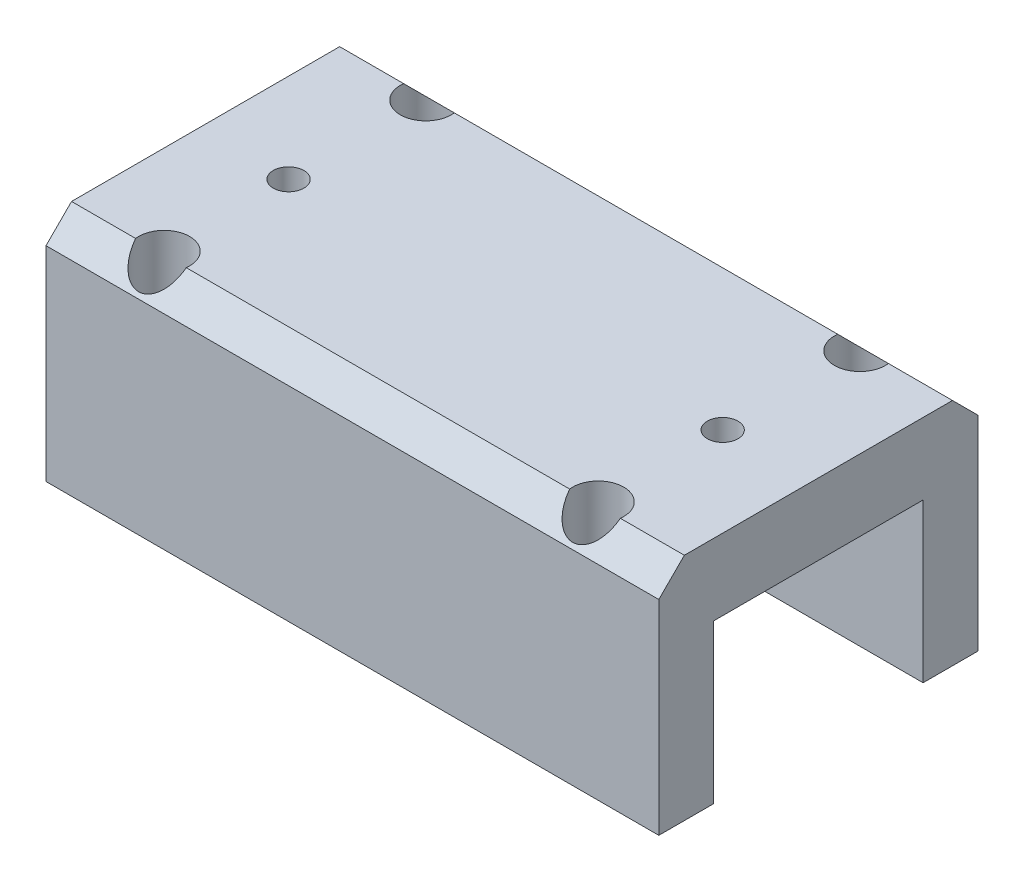
ISO-10303-21;
HEADER;
FILE_DESCRIPTION(('STEP AP214'),'2;1');
FILE_NAME('part.step','',(''),(''),'','','');
FILE_SCHEMA(('AUTOMOTIVE_DESIGN { 1 0 10303 214 1 1 1 1 }'));
ENDSEC;
DATA;
#1=APPLICATION_CONTEXT('core data for automotive mechanical design processes');
#2=APPLICATION_PROTOCOL_DEFINITION('international standard','automotive_design',2000,#1);
#3=PRODUCT_CONTEXT('',#1,'mechanical');
#4=PRODUCT('Part','Part','',(#3));
#5=PRODUCT_RELATED_PRODUCT_CATEGORY('part','',(#4));
#6=PRODUCT_DEFINITION_FORMATION('','',#4);
#7=PRODUCT_DEFINITION_CONTEXT('part definition',#1,'design');
#8=PRODUCT_DEFINITION('design','',#6,#7);
#9=PRODUCT_DEFINITION_SHAPE('','',#8);
#10=(LENGTH_UNIT() NAMED_UNIT(*) SI_UNIT(.MILLI.,.METRE.));
#11=(NAMED_UNIT(*) PLANE_ANGLE_UNIT() SI_UNIT($,.RADIAN.));
#12=(NAMED_UNIT(*) SI_UNIT($,.STERADIAN.) SOLID_ANGLE_UNIT());
#13=UNCERTAINTY_MEASURE_WITH_UNIT(LENGTH_MEASURE(1.E-05),#10,'distance_accuracy_value','');
#14=(GEOMETRIC_REPRESENTATION_CONTEXT(3) GLOBAL_UNCERTAINTY_ASSIGNED_CONTEXT((#13)) GLOBAL_UNIT_ASSIGNED_CONTEXT((#10,
#11,#12)) REPRESENTATION_CONTEXT('',''));
#15=CARTESIAN_POINT('',(0.,0.,0.));
#16=DIRECTION('',(0.,0.,1.));
#17=DIRECTION('',(1.,0.,0.));
#18=AXIS2_PLACEMENT_3D('',#15,#16,#17);
#19=CARTESIAN_POINT('',(-8.5,0.,-5.125));
#20=DIRECTION('',(0.,1.,0.));
#21=DIRECTION('',(0.,0.,1.));
#22=AXIS2_PLACEMENT_3D('',#19,#20,#21);
#23=CYLINDRICAL_SURFACE('',#22,0.500000000000001);
#24=CARTESIAN_POINT('',(-8.5,0.,-5.125));
#25=DIRECTION('',(0.,1.,0.));
#26=DIRECTION('',(0.,0.,1.));
#27=AXIS2_PLACEMENT_3D('',#24,#25,#26);
#28=CIRCLE('',#27,0.500000000000001);
#29=CARTESIAN_POINT('',(-8.5,0.,-4.625));
#30=VERTEX_POINT('',#29);
#31=EDGE_CURVE('E316',#30,#30,#28,.T.);
#32=ORIENTED_EDGE('',*,*,#31,.F.);
#33=EDGE_LOOP('',(#32));
#34=FACE_BOUND('',#33,.T.);
#35=CARTESIAN_POINT('',(-8.5,2.,-5.125));
#36=DIRECTION('',(0.,1.,0.));
#37=DIRECTION('',(0.,0.,1.));
#38=AXIS2_PLACEMENT_3D('',#35,#36,#37);
#39=CIRCLE('',#38,0.500000000000001);
#40=CARTESIAN_POINT('',(-8.5,2.,-4.625));
#41=VERTEX_POINT('',#40);
#42=EDGE_CURVE('E237',#41,#41,#39,.F.);
#43=ORIENTED_EDGE('',*,*,#42,.F.);
#44=EDGE_LOOP('',(#43));
#45=FACE_BOUND('',#44,.T.);
#46=ADVANCED_FACE('F39',(#34,#45),#23,.F.);
#47=CARTESIAN_POINT('',(8.5,0.,-5.125));
#48=DIRECTION('',(0.,1.,0.));
#49=DIRECTION('',(0.,0.,1.));
#50=AXIS2_PLACEMENT_3D('',#47,#48,#49);
#51=CYLINDRICAL_SURFACE('',#50,0.500000000000001);
#52=CARTESIAN_POINT('',(8.5,0.,-5.125));
#53=DIRECTION('',(0.,1.,0.));
#54=DIRECTION('',(0.,0.,-1.));
#55=AXIS2_PLACEMENT_3D('',#52,#53,#54);
#56=CIRCLE('',#55,0.500000000000001);
#57=CARTESIAN_POINT('',(8.5,0.,-5.62500000000001));
#58=VERTEX_POINT('',#57);
#59=EDGE_CURVE('E223',#58,#58,#56,.T.);
#60=ORIENTED_EDGE('',*,*,#59,.F.);
#61=EDGE_LOOP('',(#60));
#62=FACE_BOUND('',#61,.T.);
#63=CARTESIAN_POINT('',(8.5,2.,-5.125));
#64=DIRECTION('',(0.,1.,0.));
#65=DIRECTION('',(0.,0.,1.));
#66=AXIS2_PLACEMENT_3D('',#63,#64,#65);
#67=CIRCLE('',#66,0.500000000000001);
#68=CARTESIAN_POINT('',(8.5,2.,-4.625));
#69=VERTEX_POINT('',#68);
#70=EDGE_CURVE('E233',#69,#69,#67,.F.);
#71=ORIENTED_EDGE('',*,*,#70,.F.);
#72=EDGE_LOOP('',(#71));
#73=FACE_BOUND('',#72,.T.);
#74=ADVANCED_FACE('F389',(#62,#73),#51,.F.);
#75=CARTESIAN_POINT('',(8.5,0.,5.125));
#76=DIRECTION('',(0.,1.,0.));
#77=DIRECTION('',(0.,0.,1.));
#78=AXIS2_PLACEMENT_3D('',#75,#76,#77);
#79=CYLINDRICAL_SURFACE('',#78,0.500000000000001);
#80=CARTESIAN_POINT('',(8.5,0.,5.125));
#81=DIRECTION('',(0.,1.,0.));
#82=DIRECTION('',(0.,0.,1.));
#83=AXIS2_PLACEMENT_3D('',#80,#81,#82);
#84=CIRCLE('',#83,0.500000000000001);
#85=CARTESIAN_POINT('',(8.5,0.,5.62500000000001));
#86=VERTEX_POINT('',#85);
#87=EDGE_CURVE('E322',#86,#86,#84,.T.);
#88=ORIENTED_EDGE('',*,*,#87,.F.);
#89=EDGE_LOOP('',(#88));
#90=FACE_BOUND('',#89,.T.);
#91=CARTESIAN_POINT('',(8.5,2.,5.125));
#92=DIRECTION('',(0.,1.,0.));
#93=DIRECTION('',(0.,0.,1.));
#94=AXIS2_PLACEMENT_3D('',#91,#92,#93);
#95=CIRCLE('',#94,0.500000000000001);
#96=CARTESIAN_POINT('',(8.5,2.,5.62500000000001));
#97=VERTEX_POINT('',#96);
#98=EDGE_CURVE('E228',#97,#97,#95,.F.);
#99=ORIENTED_EDGE('',*,*,#98,.F.);
#100=EDGE_LOOP('',(#99));
#101=FACE_BOUND('',#100,.T.);
#102=ADVANCED_FACE('F392',(#90,#101),#79,.F.);
#103=CARTESIAN_POINT('',(-8.5,0.,5.125));
#104=DIRECTION('',(0.,1.,0.));
#105=DIRECTION('',(0.,0.,1.));
#106=AXIS2_PLACEMENT_3D('',#103,#104,#105);
#107=CYLINDRICAL_SURFACE('',#106,0.500000000000001);
#108=CARTESIAN_POINT('',(-8.5,0.,5.125));
#109=DIRECTION('',(0.,1.,0.));
#110=DIRECTION('',(0.,0.,-1.));
#111=AXIS2_PLACEMENT_3D('',#108,#109,#110);
#112=CIRCLE('',#111,0.500000000000001);
#113=CARTESIAN_POINT('',(-8.5,0.,4.625));
#114=VERTEX_POINT('',#113);
#115=EDGE_CURVE('E378',#114,#114,#112,.T.);
#116=ORIENTED_EDGE('',*,*,#115,.F.);
#117=EDGE_LOOP('',(#116));
#118=FACE_BOUND('',#117,.T.);
#119=CARTESIAN_POINT('',(-8.5,2.,5.125));
#120=DIRECTION('',(0.,1.,0.));
#121=DIRECTION('',(0.,0.,1.));
#122=AXIS2_PLACEMENT_3D('',#119,#120,#121);
#123=CIRCLE('',#122,0.500000000000001);
#124=CARTESIAN_POINT('',(-8.5,2.,5.625));
#125=VERTEX_POINT('',#124);
#126=EDGE_CURVE('E224',#125,#125,#123,.F.);
#127=ORIENTED_EDGE('',*,*,#126,.F.);
#128=EDGE_LOOP('',(#127));
#129=FACE_BOUND('',#128,.T.);
#130=ADVANCED_FACE('F465',(#118,#129),#107,.F.);
#131=CARTESIAN_POINT('',(0.,0.,0.));
#132=DIRECTION('',(0.,1.,0.));
#133=DIRECTION('',(0.,0.,1.));
#134=AXIS2_PLACEMENT_3D('',#131,#132,#133);
#135=PLANE('',#134);
#136=ORIENTED_EDGE('',*,*,#115,.T.);
#137=EDGE_LOOP('',(#136));
#138=FACE_BOUND('',#137,.T.);
#139=ORIENTED_EDGE('',*,*,#87,.T.);
#140=EDGE_LOOP('',(#139));
#141=FACE_BOUND('',#140,.T.);
#142=DIRECTION('',(0.,0.,1.));
#143=VECTOR('',#142,1.);
#144=CARTESIAN_POINT('',(-12.,0.,6.25));
#145=LINE('',#144,#143);
#146=CARTESIAN_POINT('',(-12.,0.,4.1));
#147=VERTEX_POINT('',#146);
#148=CARTESIAN_POINT('',(-12.,0.,6.25));
#149=VERTEX_POINT('',#148);
#150=EDGE_CURVE('E190',#147,#149,#145,.T.);
#151=ORIENTED_EDGE('',*,*,#150,.F.);
#152=DIRECTION('',(-1.,0.,0.));
#153=VECTOR('',#152,1.);
#154=CARTESIAN_POINT('',(12.,0.,4.1));
#155=LINE('',#154,#153);
#156=CARTESIAN_POINT('',(12.,0.,4.1));
#157=VERTEX_POINT('',#156);
#158=EDGE_CURVE('E162',#157,#147,#155,.T.);
#159=ORIENTED_EDGE('',*,*,#158,.F.);
#160=DIRECTION('',(0.,0.,-1.));
#161=VECTOR('',#160,1.);
#162=CARTESIAN_POINT('',(12.,0.,6.25));
#163=LINE('',#162,#161);
#164=CARTESIAN_POINT('',(12.,0.,6.25));
#165=VERTEX_POINT('',#164);
#166=EDGE_CURVE('E195',#165,#157,#163,.T.);
#167=ORIENTED_EDGE('',*,*,#166,.F.);
#168=DIRECTION('',(1.,0.,0.));
#169=VECTOR('',#168,1.);
#170=CARTESIAN_POINT('',(12.,0.,6.25));
#171=LINE('',#170,#169);
#172=EDGE_CURVE('E189',#149,#165,#171,.T.);
#173=ORIENTED_EDGE('',*,*,#172,.F.);
#174=EDGE_LOOP('',(#151,#159,#167,#173));
#175=FACE_BOUND('',#174,.T.);
#176=ADVANCED_FACE('F336',(#138,#141,#175),#135,.F.);
#177=CARTESIAN_POINT('',(-12.,9.,6.25));
#178=DIRECTION('',(1.,0.,0.));
#179=DIRECTION('',(0.,0.,-1.));
#180=AXIS2_PLACEMENT_3D('',#177,#178,#179);
#181=PLANE('',#180);
#182=DIRECTION('',(0.,-1.,0.));
#183=VECTOR('',#182,1.);
#184=CARTESIAN_POINT('',(-12.,9.,6.25));
#185=LINE('',#184,#183);
#186=CARTESIAN_POINT('',(-12.,7.99999999999999,6.25));
#187=VERTEX_POINT('',#186);
#188=EDGE_CURVE('E210',#187,#149,#185,.T.);
#189=ORIENTED_EDGE('',*,*,#188,.F.);
#190=DIRECTION('',(0.,0.707106781186549,-0.707106781186546));
#191=VECTOR('',#190,1.);
#192=CARTESIAN_POINT('',(-12.,9.,5.25));
#193=LINE('',#192,#191);
#194=CARTESIAN_POINT('',(-12.,9.,5.25));
#195=VERTEX_POINT('',#194);
#196=EDGE_CURVE('E277',#187,#195,#193,.T.);
#197=ORIENTED_EDGE('',*,*,#196,.T.);
#198=DIRECTION('',(0.,0.,1.));
#199=VECTOR('',#198,1.);
#200=CARTESIAN_POINT('',(-12.,9.,6.25));
#201=LINE('',#200,#199);
#202=CARTESIAN_POINT('',(-12.,9.,-5.25));
#203=VERTEX_POINT('',#202);
#204=EDGE_CURVE('E177',#203,#195,#201,.T.);
#205=ORIENTED_EDGE('',*,*,#204,.F.);
#206=DIRECTION('',(0.,-0.707106781186549,-0.707106781186546));
#207=VECTOR('',#206,1.);
#208=CARTESIAN_POINT('',(-12.,9.,-5.25));
#209=LINE('',#208,#207);
#210=CARTESIAN_POINT('',(-12.,8.,-6.25));
#211=VERTEX_POINT('',#210);
#212=EDGE_CURVE('E55',#203,#211,#209,.T.);
#213=ORIENTED_EDGE('',*,*,#212,.T.);
#214=DIRECTION('',(0.,-1.,0.));
#215=VECTOR('',#214,1.);
#216=CARTESIAN_POINT('',(-12.,9.,-6.25));
#217=LINE('',#216,#215);
#218=CARTESIAN_POINT('',(-12.,0.,-6.25));
#219=VERTEX_POINT('',#218);
#220=EDGE_CURVE('E186',#211,#219,#217,.T.);
#221=ORIENTED_EDGE('',*,*,#220,.T.);
#222=CARTESIAN_POINT('',(-12.,0.,-4.1));
#223=VERTEX_POINT('',#222);
#224=EDGE_CURVE('E167',#219,#223,#145,.T.);
#225=ORIENTED_EDGE('',*,*,#224,.T.);
#226=DIRECTION('',(0.,-1.,0.));
#227=VECTOR('',#226,1.);
#228=CARTESIAN_POINT('',(-12.,6.2,-4.1));
#229=LINE('',#228,#227);
#230=CARTESIAN_POINT('',(-12.,6.2,-4.1));
#231=VERTEX_POINT('',#230);
#232=EDGE_CURVE('E145',#231,#223,#229,.T.);
#233=ORIENTED_EDGE('',*,*,#232,.F.);
#234=DIRECTION('',(0.,0.,-1.));
#235=VECTOR('',#234,1.);
#236=CARTESIAN_POINT('',(-12.,6.2,-4.1));
#237=LINE('',#236,#235);
#238=CARTESIAN_POINT('',(-12.,6.2,4.1));
#239=VERTEX_POINT('',#238);
#240=EDGE_CURVE('E153',#239,#231,#237,.T.);
#241=ORIENTED_EDGE('',*,*,#240,.F.);
#242=DIRECTION('',(0.,-1.,0.));
#243=VECTOR('',#242,1.);
#244=CARTESIAN_POINT('',(-12.,6.2,4.1));
#245=LINE('',#244,#243);
#246=EDGE_CURVE('E326',#239,#147,#245,.T.);
#247=ORIENTED_EDGE('',*,*,#246,.T.);
#248=ORIENTED_EDGE('',*,*,#150,.T.);
#249=EDGE_LOOP('',(#189,#197,#205,#213,#221,#225,#233,#241,#247,#248));
#250=FACE_BOUND('',#249,.T.);
#251=ADVANCED_FACE('F165',(#250),#181,.F.);
#252=CARTESIAN_POINT('',(12.,9.,6.25));
#253=DIRECTION('',(0.,0.,-1.));
#254=DIRECTION('',(-1.,0.,0.));
#255=AXIS2_PLACEMENT_3D('',#252,#253,#254);
#256=PLANE('',#255);
#257=DIRECTION('',(0.,-1.,0.));
#258=VECTOR('',#257,1.);
#259=CARTESIAN_POINT('',(12.,9.,6.25));
#260=LINE('',#259,#258);
#261=CARTESIAN_POINT('',(12.,7.99999999999999,6.25));
#262=VERTEX_POINT('',#261);
#263=EDGE_CURVE('E207',#262,#165,#260,.T.);
#264=ORIENTED_EDGE('',*,*,#263,.F.);
#265=DIRECTION('',(-1.,0.,0.));
#266=VECTOR('',#265,1.);
#267=CARTESIAN_POINT('',(-12.,7.99999999999999,6.25));
#268=LINE('',#267,#266);
#269=EDGE_CURVE('E63',#262,#187,#268,.T.);
#270=ORIENTED_EDGE('',*,*,#269,.T.);
#271=ORIENTED_EDGE('',*,*,#188,.T.);
#272=ORIENTED_EDGE('',*,*,#172,.T.);
#273=EDGE_LOOP('',(#264,#270,#271,#272));
#274=FACE_BOUND('',#273,.T.);
#275=ADVANCED_FACE('F340',(#274),#256,.F.);
#276=CARTESIAN_POINT('',(12.,9.,6.25));
#277=DIRECTION('',(-1.,0.,0.));
#278=DIRECTION('',(0.,0.,1.));
#279=AXIS2_PLACEMENT_3D('',#276,#277,#278);
#280=PLANE('',#279);
#281=DIRECTION('',(0.,0.,-1.));
#282=VECTOR('',#281,1.);
#283=CARTESIAN_POINT('',(12.,9.,6.25));
#284=LINE('',#283,#282);
#285=CARTESIAN_POINT('',(12.,9.,5.25));
#286=VERTEX_POINT('',#285);
#287=CARTESIAN_POINT('',(12.,9.,-5.25000000000001));
#288=VERTEX_POINT('',#287);
#289=EDGE_CURVE('E181',#286,#288,#284,.T.);
#290=ORIENTED_EDGE('',*,*,#289,.F.);
#291=DIRECTION('',(0.,-0.707106781186549,0.707106781186546));
#292=VECTOR('',#291,1.);
#293=CARTESIAN_POINT('',(12.,9.,5.25));
#294=LINE('',#293,#292);
#295=EDGE_CURVE('E270',#286,#262,#294,.T.);
#296=ORIENTED_EDGE('',*,*,#295,.T.);
#297=ORIENTED_EDGE('',*,*,#263,.T.);
#298=ORIENTED_EDGE('',*,*,#166,.T.);
#299=DIRECTION('',(0.,-1.,0.));
#300=VECTOR('',#299,1.);
#301=CARTESIAN_POINT('',(12.,6.2,4.1));
#302=LINE('',#301,#300);
#303=CARTESIAN_POINT('',(12.,6.2,4.1));
#304=VERTEX_POINT('',#303);
#305=EDGE_CURVE('E172',#304,#157,#302,.T.);
#306=ORIENTED_EDGE('',*,*,#305,.F.);
#307=DIRECTION('',(0.,0.,1.));
#308=VECTOR('',#307,1.);
#309=CARTESIAN_POINT('',(12.,6.2,-4.1));
#310=LINE('',#309,#308);
#311=CARTESIAN_POINT('',(12.,6.2,-4.1));
#312=VERTEX_POINT('',#311);
#313=EDGE_CURVE('E152',#312,#304,#310,.T.);
#314=ORIENTED_EDGE('',*,*,#313,.F.);
#315=DIRECTION('',(0.,-1.,0.));
#316=VECTOR('',#315,1.);
#317=CARTESIAN_POINT('',(12.,6.2,-4.1));
#318=LINE('',#317,#316);
#319=CARTESIAN_POINT('',(12.,0.,-4.1));
#320=VERTEX_POINT('',#319);
#321=EDGE_CURVE('E148',#312,#320,#318,.T.);
#322=ORIENTED_EDGE('',*,*,#321,.T.);
#323=CARTESIAN_POINT('',(12.,0.,-6.25));
#324=VERTEX_POINT('',#323);
#325=EDGE_CURVE('E194',#320,#324,#163,.T.);
#326=ORIENTED_EDGE('',*,*,#325,.T.);
#327=DIRECTION('',(0.,-1.,0.));
#328=VECTOR('',#327,1.);
#329=CARTESIAN_POINT('',(12.,9.,-6.25));
#330=LINE('',#329,#328);
#331=CARTESIAN_POINT('',(12.,8.,-6.25));
#332=VERTEX_POINT('',#331);
#333=EDGE_CURVE('E204',#332,#324,#330,.T.);
#334=ORIENTED_EDGE('',*,*,#333,.F.);
#335=DIRECTION('',(0.,0.707106781186549,0.707106781186546));
#336=VECTOR('',#335,1.);
#337=CARTESIAN_POINT('',(12.,9.,-5.25));
#338=LINE('',#337,#336);
#339=EDGE_CURVE('E267',#332,#288,#338,.T.);
#340=ORIENTED_EDGE('',*,*,#339,.T.);
#341=EDGE_LOOP('',(#290,#296,#297,#298,#306,#314,#322,#326,#334,#340));
#342=FACE_BOUND('',#341,.T.);
#343=ADVANCED_FACE('F308',(#342),#280,.F.);
#344=CARTESIAN_POINT('',(12.,9.,-6.25));
#345=DIRECTION('',(0.,0.,1.));
#346=DIRECTION('',(1.,0.,0.));
#347=AXIS2_PLACEMENT_3D('',#344,#345,#346);
#348=PLANE('',#347);
#349=ORIENTED_EDGE('',*,*,#220,.F.);
#350=DIRECTION('',(1.,0.,0.));
#351=VECTOR('',#350,1.);
#352=CARTESIAN_POINT('',(12.,8.,-6.25));
#353=LINE('',#352,#351);
#354=EDGE_CURVE('E11',#211,#332,#353,.T.);
#355=ORIENTED_EDGE('',*,*,#354,.T.);
#356=ORIENTED_EDGE('',*,*,#333,.T.);
#357=DIRECTION('',(-1.,0.,0.));
#358=VECTOR('',#357,1.);
#359=CARTESIAN_POINT('',(12.,0.,-6.25));
#360=LINE('',#359,#358);
#361=EDGE_CURVE('E182',#324,#219,#360,.T.);
#362=ORIENTED_EDGE('',*,*,#361,.T.);
#363=EDGE_LOOP('',(#349,#355,#356,#362));
#364=FACE_BOUND('',#363,.T.);
#365=ADVANCED_FACE('F304',(#364),#348,.F.);
#366=CARTESIAN_POINT('',(0.,9.,0.));
#367=DIRECTION('',(0.,1.,0.));
#368=DIRECTION('',(0.,0.,1.));
#369=AXIS2_PLACEMENT_3D('',#366,#367,#368);
#370=PLANE('',#369);
#371=ORIENTED_EDGE('',*,*,#204,.T.);
#372=DIRECTION('',(1.,0.,0.));
#373=VECTOR('',#372,1.);
#374=CARTESIAN_POINT('',(12.,9.,5.25));
#375=LINE('',#374,#373);
#376=CARTESIAN_POINT('',(-9.49215674164922,9.,5.25));
#377=VERTEX_POINT('',#376);
#378=EDGE_CURVE('E257',#195,#377,#375,.T.);
#379=ORIENTED_EDGE('',*,*,#378,.T.);
#380=CARTESIAN_POINT('',(-8.5,9.,5.125));
#381=DIRECTION('',(0.,1.,0.));
#382=DIRECTION('',(0.,0.,1.));
#383=AXIS2_PLACEMENT_3D('',#380,#381,#382);
#384=CIRCLE('',#383,1.);
#385=CARTESIAN_POINT('',(-7.50784325835078,9.,5.25));
#386=VERTEX_POINT('',#385);
#387=EDGE_CURVE('E349',#386,#377,#384,.T.);
#388=ORIENTED_EDGE('',*,*,#387,.F.);
#389=DIRECTION('',(1.,0.,0.));
#390=VECTOR('',#389,1.);
#391=CARTESIAN_POINT('',(12.,9.,5.25));
#392=LINE('',#391,#390);
#393=CARTESIAN_POINT('',(7.50784325835078,9.,5.25));
#394=VERTEX_POINT('',#393);
#395=EDGE_CURVE('E254',#386,#394,#392,.T.);
#396=ORIENTED_EDGE('',*,*,#395,.T.);
#397=CARTESIAN_POINT('',(8.5,9.,5.125));
#398=DIRECTION('',(0.,1.,0.));
#399=DIRECTION('',(0.,0.,1.));
#400=AXIS2_PLACEMENT_3D('',#397,#398,#399);
#401=CIRCLE('',#400,1.);
#402=CARTESIAN_POINT('',(9.49215674164922,9.,5.25));
#403=VERTEX_POINT('',#402);
#404=EDGE_CURVE('E362',#403,#394,#401,.T.);
#405=ORIENTED_EDGE('',*,*,#404,.F.);
#406=DIRECTION('',(1.,0.,0.));
#407=VECTOR('',#406,1.);
#408=CARTESIAN_POINT('',(12.,9.,5.25));
#409=LINE('',#408,#407);
#410=EDGE_CURVE('E251',#403,#286,#409,.T.);
#411=ORIENTED_EDGE('',*,*,#410,.T.);
#412=ORIENTED_EDGE('',*,*,#289,.T.);
#413=DIRECTION('',(-1.,0.,0.));
#414=VECTOR('',#413,1.);
#415=CARTESIAN_POINT('',(-12.,9.,-5.25));
#416=LINE('',#415,#414);
#417=CARTESIAN_POINT('',(9.49215674164922,9.,-5.25));
#418=VERTEX_POINT('',#417);
#419=EDGE_CURVE('E247',#288,#418,#416,.T.);
#420=ORIENTED_EDGE('',*,*,#419,.T.);
#421=CARTESIAN_POINT('',(8.5,9.,-5.125));
#422=DIRECTION('',(0.,1.,0.));
#423=DIRECTION('',(0.,0.,1.));
#424=AXIS2_PLACEMENT_3D('',#421,#422,#423);
#425=CIRCLE('',#424,1.);
#426=CARTESIAN_POINT('',(7.50784325835078,9.,-5.25));
#427=VERTEX_POINT('',#426);
#428=EDGE_CURVE('E359',#427,#418,#425,.T.);
#429=ORIENTED_EDGE('',*,*,#428,.F.);
#430=DIRECTION('',(-1.,0.,0.));
#431=VECTOR('',#430,1.);
#432=CARTESIAN_POINT('',(-12.,9.,-5.25));
#433=LINE('',#432,#431);
#434=CARTESIAN_POINT('',(-7.50784325835078,9.,-5.25));
#435=VERTEX_POINT('',#434);
#436=EDGE_CURVE('E244',#427,#435,#433,.T.);
#437=ORIENTED_EDGE('',*,*,#436,.T.);
#438=CARTESIAN_POINT('',(-8.5,9.,-5.125));
#439=DIRECTION('',(0.,1.,0.));
#440=DIRECTION('',(0.,0.,1.));
#441=AXIS2_PLACEMENT_3D('',#438,#439,#440);
#442=CIRCLE('',#441,1.);
#443=CARTESIAN_POINT('',(-9.49215674164922,9.,-5.25));
#444=VERTEX_POINT('',#443);
#445=EDGE_CURVE('E288',#444,#435,#442,.T.);
#446=ORIENTED_EDGE('',*,*,#445,.F.);
#447=DIRECTION('',(-1.,0.,0.));
#448=VECTOR('',#447,1.);
#449=CARTESIAN_POINT('',(-12.,9.,-5.25));
#450=LINE('',#449,#448);
#451=EDGE_CURVE('E213',#444,#203,#450,.T.);
#452=ORIENTED_EDGE('',*,*,#451,.T.);
#453=EDGE_LOOP('',(#371,#379,#388,#396,#405,#411,#412,#420,#429,#437,#446,#452));
#454=FACE_BOUND('',#453,.T.);
#455=CARTESIAN_POINT('',(-8.5,9.,0.25));
#456=DIRECTION('',(0.,1.,0.));
#457=DIRECTION('',(0.,0.,1.));
#458=AXIS2_PLACEMENT_3D('',#455,#456,#457);
#459=CIRCLE('',#458,0.6);
#460=CARTESIAN_POINT('',(-8.5,9.,0.85));
#461=VERTEX_POINT('',#460);
#462=EDGE_CURVE('E219',#461,#461,#459,.T.);
#463=ORIENTED_EDGE('',*,*,#462,.F.);
#464=EDGE_LOOP('',(#463));
#465=FACE_BOUND('',#464,.T.);
#466=CARTESIAN_POINT('',(8.5,9.,0.249999999999998));
#467=DIRECTION('',(0.,1.,0.));
#468=DIRECTION('',(0.,0.,-1.));
#469=AXIS2_PLACEMENT_3D('',#466,#467,#468);
#470=CIRCLE('',#469,0.6);
#471=CARTESIAN_POINT('',(8.5,9.,-0.350000000000002));
#472=VERTEX_POINT('',#471);
#473=EDGE_CURVE('E241',#472,#472,#470,.T.);
#474=ORIENTED_EDGE('',*,*,#473,.F.);
#475=EDGE_LOOP('',(#474));
#476=FACE_BOUND('',#475,.T.);
#477=ADVANCED_FACE('F293',(#454,#465,#476),#370,.T.);
#478=ORIENTED_EDGE('',*,*,#59,.T.);
#479=EDGE_LOOP('',(#478));
#480=FACE_BOUND('',#479,.T.);
#481=ORIENTED_EDGE('',*,*,#31,.T.);
#482=EDGE_LOOP('',(#481));
#483=FACE_BOUND('',#482,.T.);
#484=ORIENTED_EDGE('',*,*,#325,.F.);
#485=DIRECTION('',(1.,0.,0.));
#486=VECTOR('',#485,1.);
#487=CARTESIAN_POINT('',(12.,0.,-4.1));
#488=LINE('',#487,#486);
#489=EDGE_CURVE('E314',#223,#320,#488,.T.);
#490=ORIENTED_EDGE('',*,*,#489,.F.);
#491=ORIENTED_EDGE('',*,*,#224,.F.);
#492=ORIENTED_EDGE('',*,*,#361,.F.);
#493=EDGE_LOOP('',(#484,#490,#491,#492));
#494=FACE_BOUND('',#493,.T.);
#495=ADVANCED_FACE('F313',(#480,#483,#494),#135,.F.);
#496=CARTESIAN_POINT('',(12.,6.2,4.1));
#497=DIRECTION('',(0.,0.,1.));
#498=DIRECTION('',(1.,0.,0.));
#499=AXIS2_PLACEMENT_3D('',#496,#497,#498);
#500=PLANE('',#499);
#501=ORIENTED_EDGE('',*,*,#158,.T.);
#502=ORIENTED_EDGE('',*,*,#246,.F.);
#503=DIRECTION('',(-1.,0.,0.));
#504=VECTOR('',#503,1.);
#505=CARTESIAN_POINT('',(12.,6.2,4.1));
#506=LINE('',#505,#504);
#507=EDGE_CURVE('E159',#304,#239,#506,.T.);
#508=ORIENTED_EDGE('',*,*,#507,.F.);
#509=ORIENTED_EDGE('',*,*,#305,.T.);
#510=EDGE_LOOP('',(#501,#502,#508,#509));
#511=FACE_BOUND('',#510,.T.);
#512=ADVANCED_FACE('F332',(#511),#500,.F.);
#513=CARTESIAN_POINT('',(12.,6.2,-4.1));
#514=DIRECTION('',(0.,0.,-1.));
#515=DIRECTION('',(-1.,0.,0.));
#516=AXIS2_PLACEMENT_3D('',#513,#514,#515);
#517=PLANE('',#516);
#518=ORIENTED_EDGE('',*,*,#489,.T.);
#519=ORIENTED_EDGE('',*,*,#321,.F.);
#520=DIRECTION('',(1.,0.,0.));
#521=VECTOR('',#520,1.);
#522=CARTESIAN_POINT('',(12.,6.2,-4.1));
#523=LINE('',#522,#521);
#524=EDGE_CURVE('E141',#231,#312,#523,.T.);
#525=ORIENTED_EDGE('',*,*,#524,.F.);
#526=ORIENTED_EDGE('',*,*,#232,.T.);
#527=EDGE_LOOP('',(#518,#519,#525,#526));
#528=FACE_BOUND('',#527,.T.);
#529=ADVANCED_FACE('F143',(#528),#517,.F.);
#530=CARTESIAN_POINT('',(0.,6.2,0.));
#531=DIRECTION('',(0.,-1.,0.));
#532=DIRECTION('',(0.,0.,-1.));
#533=AXIS2_PLACEMENT_3D('',#530,#531,#532);
#534=PLANE('',#533);
#535=CARTESIAN_POINT('',(-8.5,6.2,0.25));
#536=DIRECTION('',(0.,-1.,0.));
#537=DIRECTION('',(0.,0.,-1.));
#538=AXIS2_PLACEMENT_3D('',#535,#536,#537);
#539=CIRCLE('',#538,0.6);
#540=CARTESIAN_POINT('',(-8.5,6.2,-0.35));
#541=VERTEX_POINT('',#540);
#542=EDGE_CURVE('E218',#541,#541,#539,.T.);
#543=ORIENTED_EDGE('',*,*,#542,.F.);
#544=EDGE_LOOP('',(#543));
#545=FACE_BOUND('',#544,.T.);
#546=CARTESIAN_POINT('',(8.5,6.2,0.249999999999998));
#547=DIRECTION('',(0.,-1.,0.));
#548=DIRECTION('',(0.,0.,-1.));
#549=AXIS2_PLACEMENT_3D('',#546,#547,#548);
#550=CIRCLE('',#549,0.6);
#551=CARTESIAN_POINT('',(8.5,6.2,-0.350000000000002));
#552=VERTEX_POINT('',#551);
#553=EDGE_CURVE('E214',#552,#552,#550,.T.);
#554=ORIENTED_EDGE('',*,*,#553,.F.);
#555=EDGE_LOOP('',(#554));
#556=FACE_BOUND('',#555,.T.);
#557=ORIENTED_EDGE('',*,*,#240,.T.);
#558=ORIENTED_EDGE('',*,*,#524,.T.);
#559=ORIENTED_EDGE('',*,*,#313,.T.);
#560=ORIENTED_EDGE('',*,*,#507,.T.);
#561=EDGE_LOOP('',(#557,#558,#559,#560));
#562=FACE_BOUND('',#561,.T.);
#563=ADVANCED_FACE('F157',(#545,#556,#562),#534,.T.);
#564=CARTESIAN_POINT('',(8.5,0.,0.249999999999998));
#565=DIRECTION('',(0.,1.,0.));
#566=DIRECTION('',(0.,0.,1.));
#567=AXIS2_PLACEMENT_3D('',#564,#565,#566);
#568=CYLINDRICAL_SURFACE('',#567,0.6);
#569=ORIENTED_EDGE('',*,*,#553,.T.);
#570=EDGE_LOOP('',(#569));
#571=FACE_BOUND('',#570,.T.);
#572=ORIENTED_EDGE('',*,*,#473,.T.);
#573=EDGE_LOOP('',(#572));
#574=FACE_BOUND('',#573,.T.);
#575=ADVANCED_FACE('F424',(#571,#574),#568,.F.);
#576=CARTESIAN_POINT('',(-8.5,0.,0.25));
#577=DIRECTION('',(0.,1.,0.));
#578=DIRECTION('',(0.,0.,1.));
#579=AXIS2_PLACEMENT_3D('',#576,#577,#578);
#580=CYLINDRICAL_SURFACE('',#579,0.6);
#581=ORIENTED_EDGE('',*,*,#542,.T.);
#582=EDGE_LOOP('',(#581));
#583=FACE_BOUND('',#582,.T.);
#584=ORIENTED_EDGE('',*,*,#462,.T.);
#585=EDGE_LOOP('',(#584));
#586=FACE_BOUND('',#585,.T.);
#587=ADVANCED_FACE('F456',(#583,#586),#580,.F.);
#588=CARTESIAN_POINT('',(-8.5,2.,5.125));
#589=DIRECTION('',(0.,1.,0.));
#590=DIRECTION('',(0.,0.,1.));
#591=AXIS2_PLACEMENT_3D('',#588,#589,#590);
#592=PLANE('',#591);
#593=CARTESIAN_POINT('',(-8.5,2.,5.125));
#594=DIRECTION('',(0.,1.,0.));
#595=DIRECTION('',(0.,0.,1.));
#596=AXIS2_PLACEMENT_3D('',#593,#594,#595);
#597=CIRCLE('',#596,1.);
#598=CARTESIAN_POINT('',(-8.5,2.,6.125));
#599=VERTEX_POINT('',#598);
#600=EDGE_CURVE('E353',#599,#599,#597,.T.);
#601=ORIENTED_EDGE('',*,*,#600,.T.);
#602=EDGE_LOOP('',(#601));
#603=FACE_BOUND('',#602,.T.);
#604=ORIENTED_EDGE('',*,*,#126,.T.);
#605=EDGE_LOOP('',(#604));
#606=FACE_BOUND('',#605,.T.);
#607=ADVANCED_FACE('F459',(#603,#606),#592,.T.);
#608=CARTESIAN_POINT('',(-8.5,2.,5.125));
#609=DIRECTION('',(0.,1.,0.));
#610=DIRECTION('',(0.,0.,1.));
#611=AXIS2_PLACEMENT_3D('',#608,#609,#610);
#612=CYLINDRICAL_SURFACE('',#611,1.);
#613=ORIENTED_EDGE('',*,*,#600,.F.);
#614=EDGE_LOOP('',(#613));
#615=FACE_BOUND('',#614,.T.);
#616=ORIENTED_EDGE('',*,*,#387,.T.);
#617=CARTESIAN_POINT('',(-8.5,9.125,5.125));
#618=DIRECTION('',(0.,0.707106781186546,0.707106781186549));
#619=DIRECTION('',(0.,0.707106781186549,-0.707106781186546));
#620=AXIS2_PLACEMENT_3D('',#617,#618,#619);
#621=ELLIPSE('',#620,1.4142135623731,1.);
#622=EDGE_CURVE('E261',#377,#386,#621,.T.);
#623=ORIENTED_EDGE('',*,*,#622,.T.);
#624=EDGE_LOOP('',(#616,#623));
#625=FACE_BOUND('',#624,.T.);
#626=ADVANCED_FACE('F351',(#615,#625),#612,.F.);
#627=CARTESIAN_POINT('',(8.5,2.,5.125));
#628=DIRECTION('',(0.,1.,0.));
#629=DIRECTION('',(0.,0.,1.));
#630=AXIS2_PLACEMENT_3D('',#627,#628,#629);
#631=PLANE('',#630);
#632=CARTESIAN_POINT('',(8.5,2.,5.125));
#633=DIRECTION('',(0.,1.,0.));
#634=DIRECTION('',(0.,0.,1.));
#635=AXIS2_PLACEMENT_3D('',#632,#633,#634);
#636=CIRCLE('',#635,1.);
#637=CARTESIAN_POINT('',(8.5,2.,6.125));
#638=VERTEX_POINT('',#637);
#639=EDGE_CURVE('E354',#638,#638,#636,.T.);
#640=ORIENTED_EDGE('',*,*,#639,.T.);
#641=EDGE_LOOP('',(#640));
#642=FACE_BOUND('',#641,.T.);
#643=ORIENTED_EDGE('',*,*,#98,.T.);
#644=EDGE_LOOP('',(#643));
#645=FACE_BOUND('',#644,.T.);
#646=ADVANCED_FACE('F409',(#642,#645),#631,.T.);
#647=CARTESIAN_POINT('',(8.5,2.,5.125));
#648=DIRECTION('',(0.,1.,0.));
#649=DIRECTION('',(0.,0.,1.));
#650=AXIS2_PLACEMENT_3D('',#647,#648,#649);
#651=CYLINDRICAL_SURFACE('',#650,1.);
#652=ORIENTED_EDGE('',*,*,#639,.F.);
#653=EDGE_LOOP('',(#652));
#654=FACE_BOUND('',#653,.T.);
#655=ORIENTED_EDGE('',*,*,#404,.T.);
#656=CARTESIAN_POINT('',(8.5,9.12499999999999,5.125));
#657=DIRECTION('',(0.,0.707106781186546,0.707106781186549));
#658=DIRECTION('',(0.,0.707106781186549,-0.707106781186546));
#659=AXIS2_PLACEMENT_3D('',#656,#657,#658);
#660=ELLIPSE('',#659,1.4142135623731,1.);
#661=EDGE_CURVE('E264',#394,#403,#660,.T.);
#662=ORIENTED_EDGE('',*,*,#661,.T.);
#663=EDGE_LOOP('',(#655,#662));
#664=FACE_BOUND('',#663,.T.);
#665=ADVANCED_FACE('F399',(#654,#664),#651,.F.);
#666=CARTESIAN_POINT('',(8.5,2.,-5.125));
#667=DIRECTION('',(0.,1.,0.));
#668=DIRECTION('',(0.,0.,1.));
#669=AXIS2_PLACEMENT_3D('',#666,#667,#668);
#670=PLANE('',#669);
#671=CARTESIAN_POINT('',(8.5,2.,-5.125));
#672=DIRECTION('',(0.,1.,0.));
#673=DIRECTION('',(0.,0.,1.));
#674=AXIS2_PLACEMENT_3D('',#671,#672,#673);
#675=CIRCLE('',#674,1.);
#676=CARTESIAN_POINT('',(8.5,2.,-4.125));
#677=VERTEX_POINT('',#676);
#678=EDGE_CURVE('E297',#677,#677,#675,.T.);
#679=ORIENTED_EDGE('',*,*,#678,.T.);
#680=EDGE_LOOP('',(#679));
#681=FACE_BOUND('',#680,.T.);
#682=ORIENTED_EDGE('',*,*,#70,.T.);
#683=EDGE_LOOP('',(#682));
#684=FACE_BOUND('',#683,.T.);
#685=ADVANCED_FACE('F396',(#681,#684),#670,.T.);
#686=CARTESIAN_POINT('',(8.5,2.,-5.125));
#687=DIRECTION('',(0.,1.,0.));
#688=DIRECTION('',(0.,0.,1.));
#689=AXIS2_PLACEMENT_3D('',#686,#687,#688);
#690=CYLINDRICAL_SURFACE('',#689,1.);
#691=ORIENTED_EDGE('',*,*,#678,.F.);
#692=EDGE_LOOP('',(#691));
#693=FACE_BOUND('',#692,.T.);
#694=ORIENTED_EDGE('',*,*,#428,.T.);
#695=CARTESIAN_POINT('',(8.5,9.125,-5.125));
#696=DIRECTION('',(0.,0.707106781186546,-0.707106781186549));
#697=DIRECTION('',(0.,0.707106781186549,0.707106781186546));
#698=AXIS2_PLACEMENT_3D('',#695,#696,#697);
#699=ELLIPSE('',#698,1.4142135623731,1.);
#700=EDGE_CURVE('E280',#418,#427,#699,.T.);
#701=ORIENTED_EDGE('',*,*,#700,.T.);
#702=EDGE_LOOP('',(#694,#701));
#703=FACE_BOUND('',#702,.T.);
#704=ADVANCED_FACE('F398',(#693,#703),#690,.F.);
#705=CARTESIAN_POINT('',(-8.5,2.,-5.125));
#706=DIRECTION('',(0.,1.,0.));
#707=DIRECTION('',(0.,0.,1.));
#708=AXIS2_PLACEMENT_3D('',#705,#706,#707);
#709=PLANE('',#708);
#710=CARTESIAN_POINT('',(-8.5,2.,-5.125));
#711=DIRECTION('',(0.,1.,0.));
#712=DIRECTION('',(0.,0.,1.));
#713=AXIS2_PLACEMENT_3D('',#710,#711,#712);
#714=CIRCLE('',#713,1.);
#715=CARTESIAN_POINT('',(-8.5,2.,-4.125));
#716=VERTEX_POINT('',#715);
#717=EDGE_CURVE('E229',#716,#716,#714,.T.);
#718=ORIENTED_EDGE('',*,*,#717,.T.);
#719=EDGE_LOOP('',(#718));
#720=FACE_BOUND('',#719,.T.);
#721=ORIENTED_EDGE('',*,*,#42,.T.);
#722=EDGE_LOOP('',(#721));
#723=FACE_BOUND('',#722,.T.);
#724=ADVANCED_FACE('F406',(#720,#723),#709,.T.);
#725=CARTESIAN_POINT('',(-8.5,2.,-5.125));
#726=DIRECTION('',(0.,1.,0.));
#727=DIRECTION('',(0.,0.,1.));
#728=AXIS2_PLACEMENT_3D('',#725,#726,#727);
#729=CYLINDRICAL_SURFACE('',#728,1.);
#730=ORIENTED_EDGE('',*,*,#717,.F.);
#731=EDGE_LOOP('',(#730));
#732=FACE_BOUND('',#731,.T.);
#733=ORIENTED_EDGE('',*,*,#445,.T.);
#734=CARTESIAN_POINT('',(-8.5,9.125,-5.125));
#735=DIRECTION('',(0.,0.707106781186546,-0.707106781186549));
#736=DIRECTION('',(0.,0.707106781186549,0.707106781186546));
#737=AXIS2_PLACEMENT_3D('',#734,#735,#736);
#738=ELLIPSE('',#737,1.4142135623731,1.);
#739=EDGE_CURVE('E48',#435,#444,#738,.T.);
#740=ORIENTED_EDGE('',*,*,#739,.T.);
#741=EDGE_LOOP('',(#733,#740));
#742=FACE_BOUND('',#741,.T.);
#743=ADVANCED_FACE('F287',(#732,#742),#729,.F.);
#744=CARTESIAN_POINT('',(0.,9.,5.25));
#745=DIRECTION('',(0.,0.707106781186546,0.707106781186549));
#746=DIRECTION('',(-1.,0.,0.));
#747=AXIS2_PLACEMENT_3D('',#744,#745,#746);
#748=PLANE('',#747);
#749=ORIENTED_EDGE('',*,*,#196,.F.);
#750=ORIENTED_EDGE('',*,*,#269,.F.);
#751=ORIENTED_EDGE('',*,*,#295,.F.);
#752=ORIENTED_EDGE('',*,*,#410,.F.);
#753=ORIENTED_EDGE('',*,*,#661,.F.);
#754=ORIENTED_EDGE('',*,*,#395,.F.);
#755=ORIENTED_EDGE('',*,*,#622,.F.);
#756=ORIENTED_EDGE('',*,*,#378,.F.);
#757=EDGE_LOOP('',(#749,#750,#751,#752,#753,#754,#755,#756));
#758=FACE_BOUND('',#757,.T.);
#759=ADVANCED_FACE('F345',(#758),#748,.T.);
#760=CARTESIAN_POINT('',(0.,9.,-5.25));
#761=DIRECTION('',(0.,0.707106781186546,-0.707106781186549));
#762=DIRECTION('',(1.,0.,0.));
#763=AXIS2_PLACEMENT_3D('',#760,#761,#762);
#764=PLANE('',#763);
#765=ORIENTED_EDGE('',*,*,#339,.F.);
#766=ORIENTED_EDGE('',*,*,#354,.F.);
#767=ORIENTED_EDGE('',*,*,#212,.F.);
#768=ORIENTED_EDGE('',*,*,#451,.F.);
#769=ORIENTED_EDGE('',*,*,#739,.F.);
#770=ORIENTED_EDGE('',*,*,#436,.F.);
#771=ORIENTED_EDGE('',*,*,#700,.F.);
#772=ORIENTED_EDGE('',*,*,#419,.F.);
#773=EDGE_LOOP('',(#765,#766,#767,#768,#769,#770,#771,#772));
#774=FACE_BOUND('',#773,.T.);
#775=ADVANCED_FACE('F41',(#774),#764,.T.);
#776=CLOSED_SHELL('',(#46,#74,#102,#130,#176,#251,#275,#343,#365,#477,#495,#512,#529,#563,#575,
#587,#607,#626,#646,#665,#685,#704,#724,#743,#759,#775));
#777=MANIFOLD_SOLID_BREP('B2',#776);
#778=ADVANCED_BREP_SHAPE_REPRESENTATION('',(#18,#777),#14);
#779=SHAPE_DEFINITION_REPRESENTATION(#9,#778);
ENDSEC;
END-ISO-10303-21;
